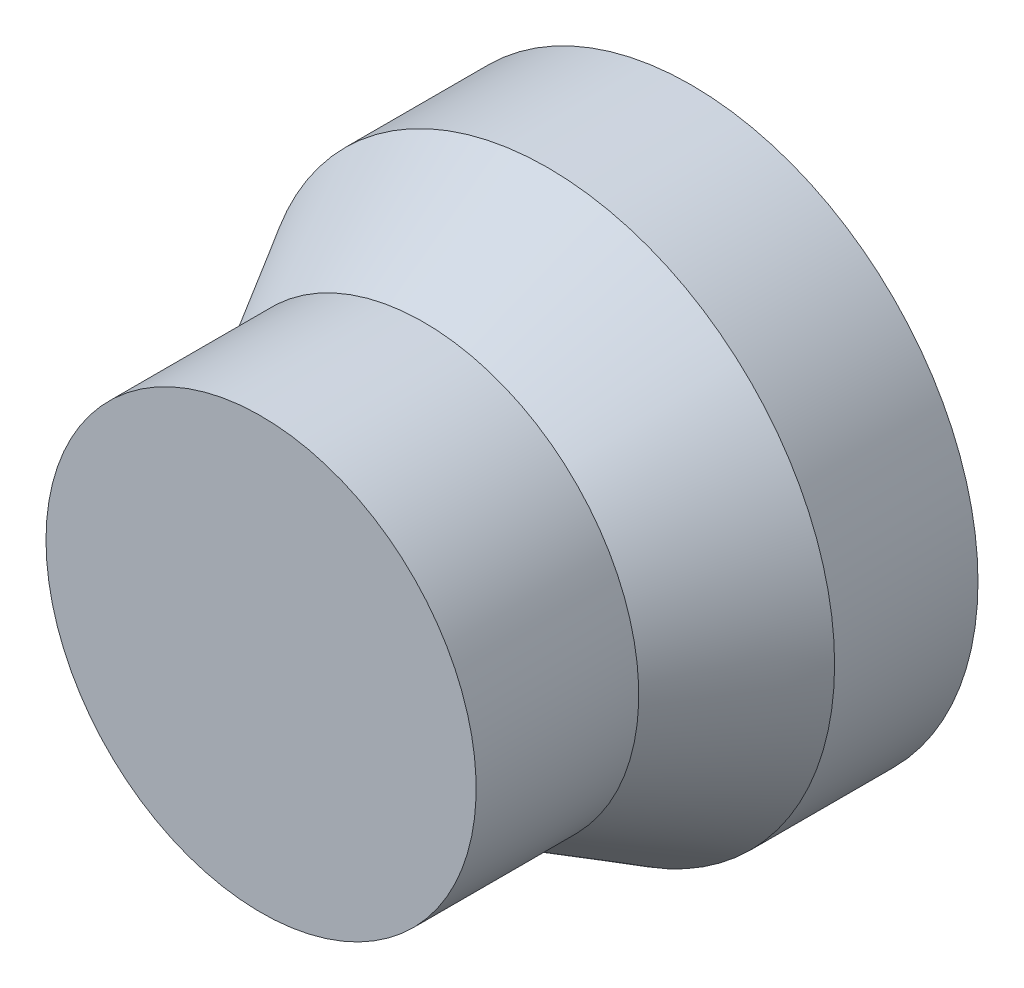
ISO-10303-21;
HEADER;
FILE_DESCRIPTION(('STEP AP214'),'2;1');
FILE_NAME('part.step','',(''),(''),'','','');
FILE_SCHEMA(('AUTOMOTIVE_DESIGN { 1 0 10303 214 1 1 1 1 }'));
ENDSEC;
DATA;
#1=APPLICATION_CONTEXT('core data for automotive mechanical design processes');
#2=APPLICATION_PROTOCOL_DEFINITION('international standard','automotive_design',2000,#1);
#3=PRODUCT_CONTEXT('',#1,'mechanical');
#4=PRODUCT('Part','Part','',(#3));
#5=PRODUCT_RELATED_PRODUCT_CATEGORY('part','',(#4));
#6=PRODUCT_DEFINITION_FORMATION('','',#4);
#7=PRODUCT_DEFINITION_CONTEXT('part definition',#1,'design');
#8=PRODUCT_DEFINITION('design','',#6,#7);
#9=PRODUCT_DEFINITION_SHAPE('','',#8);
#10=(LENGTH_UNIT() NAMED_UNIT(*) SI_UNIT(.MILLI.,.METRE.));
#11=(NAMED_UNIT(*) PLANE_ANGLE_UNIT() SI_UNIT($,.RADIAN.));
#12=(NAMED_UNIT(*) SI_UNIT($,.STERADIAN.) SOLID_ANGLE_UNIT());
#13=UNCERTAINTY_MEASURE_WITH_UNIT(LENGTH_MEASURE(1.E-05),#10,'distance_accuracy_value','');
#14=(GEOMETRIC_REPRESENTATION_CONTEXT(3) GLOBAL_UNCERTAINTY_ASSIGNED_CONTEXT((#13)) GLOBAL_UNIT_ASSIGNED_CONTEXT((#10,
#11,#12)) REPRESENTATION_CONTEXT('',''));
#15=CARTESIAN_POINT('',(0.,0.,0.));
#16=DIRECTION('',(0.,0.,1.));
#17=DIRECTION('',(1.,0.,0.));
#18=AXIS2_PLACEMENT_3D('',#15,#16,#17);
#19=CARTESIAN_POINT('',(0.,0.,150.));
#20=DIRECTION('',(0.,0.,-1.));
#21=DIRECTION('',(-1.,0.,0.));
#22=AXIS2_PLACEMENT_3D('',#19,#20,#21);
#23=PLANE('',#22);
#24=CARTESIAN_POINT('',(0.,0.,150.));
#25=DIRECTION('',(0.,0.,-1.));
#26=DIRECTION('',(-1.,0.,0.));
#27=AXIS2_PLACEMENT_3D('',#24,#25,#26);
#28=CIRCLE('',#27,75.);
#29=CARTESIAN_POINT('',(-75.,0.,150.));
#30=VERTEX_POINT('',#29);
#31=EDGE_CURVE('E10',#30,#30,#28,.T.);
#32=ORIENTED_EDGE('',*,*,#31,.F.);
#33=EDGE_LOOP('',(#32));
#34=FACE_BOUND('',#33,.T.);
#35=ADVANCED_FACE('F31',(#34),#23,.F.);
#36=CARTESIAN_POINT('',(0.,0.,-165.573770491803));
#37=DIRECTION('',(0.,0.,-1.));
#38=DIRECTION('',(-1.,0.,0.));
#39=AXIS2_PLACEMENT_3D('',#36,#37,#38);
#40=CYLINDRICAL_SURFACE('',#39,75.);
#41=CARTESIAN_POINT('',(0.,0.,93.3012701892219));
#42=DIRECTION('',(0.,0.,-1.));
#43=DIRECTION('',(-1.,0.,0.));
#44=AXIS2_PLACEMENT_3D('',#41,#42,#43);
#45=CIRCLE('',#44,75.);
#46=CARTESIAN_POINT('',(-75.,0.,93.3012701892219));
#47=VERTEX_POINT('',#46);
#48=EDGE_CURVE('E37',#47,#47,#45,.T.);
#49=ORIENTED_EDGE('',*,*,#48,.F.);
#50=EDGE_LOOP('',(#49));
#51=FACE_BOUND('',#50,.T.);
#52=ORIENTED_EDGE('',*,*,#31,.T.);
#53=EDGE_LOOP('',(#52));
#54=FACE_BOUND('',#53,.T.);
#55=ADVANCED_FACE('F61',(#51,#54),#40,.T.);
#56=CARTESIAN_POINT('',(0.,0.,93.3012701892219));
#57=DIRECTION('',(0.,0.,-1.));
#58=DIRECTION('',(-1.,0.,0.));
#59=AXIS2_PLACEMENT_3D('',#56,#57,#58);
#60=CONICAL_SURFACE('',#59,75.,0.523598775598299);
#61=CARTESIAN_POINT('',(0.,0.,50.));
#62=DIRECTION('',(0.,0.,-1.));
#63=DIRECTION('',(-1.,0.,0.));
#64=AXIS2_PLACEMENT_3D('',#61,#62,#63);
#65=CIRCLE('',#64,100.);
#66=CARTESIAN_POINT('',(-100.,0.,50.));
#67=VERTEX_POINT('',#66);
#68=EDGE_CURVE('E41',#67,#67,#65,.T.);
#69=ORIENTED_EDGE('',*,*,#68,.F.);
#70=EDGE_LOOP('',(#69));
#71=FACE_BOUND('',#70,.T.);
#72=ORIENTED_EDGE('',*,*,#48,.T.);
#73=EDGE_LOOP('',(#72));
#74=FACE_BOUND('',#73,.T.);
#75=ADVANCED_FACE('F56',(#71,#74),#60,.T.);
#76=CARTESIAN_POINT('',(0.,0.,-165.573770491803));
#77=DIRECTION('',(0.,0.,-1.));
#78=DIRECTION('',(-1.,0.,0.));
#79=AXIS2_PLACEMENT_3D('',#76,#77,#78);
#80=CYLINDRICAL_SURFACE('',#79,100.);
#81=CARTESIAN_POINT('',(0.,0.,0.));
#82=DIRECTION('',(0.,0.,-1.));
#83=DIRECTION('',(-1.,0.,0.));
#84=AXIS2_PLACEMENT_3D('',#81,#82,#83);
#85=CIRCLE('',#84,100.);
#86=CARTESIAN_POINT('',(-100.,0.,0.));
#87=VERTEX_POINT('',#86);
#88=EDGE_CURVE('E45',#87,#87,#85,.T.);
#89=ORIENTED_EDGE('',*,*,#88,.F.);
#90=EDGE_LOOP('',(#89));
#91=FACE_BOUND('',#90,.T.);
#92=ORIENTED_EDGE('',*,*,#68,.T.);
#93=EDGE_LOOP('',(#92));
#94=FACE_BOUND('',#93,.T.);
#95=ADVANCED_FACE('F53',(#91,#94),#80,.T.);
#96=CARTESIAN_POINT('',(100.,0.,0.));
#97=DIRECTION('',(0.,0.,1.));
#98=DIRECTION('',(1.,0.,0.));
#99=AXIS2_PLACEMENT_3D('',#96,#97,#98);
#100=PLANE('',#99);
#101=ORIENTED_EDGE('',*,*,#88,.T.);
#102=EDGE_LOOP('',(#101));
#103=FACE_BOUND('',#102,.T.);
#104=ADVANCED_FACE('F51',(#103),#100,.F.);
#105=CLOSED_SHELL('',(#35,#55,#75,#95,#104));
#106=MANIFOLD_SOLID_BREP('B2',#105);
#107=ADVANCED_BREP_SHAPE_REPRESENTATION('',(#18,#106),#14);
#108=SHAPE_DEFINITION_REPRESENTATION(#9,#107);
ENDSEC;
END-ISO-10303-21;
